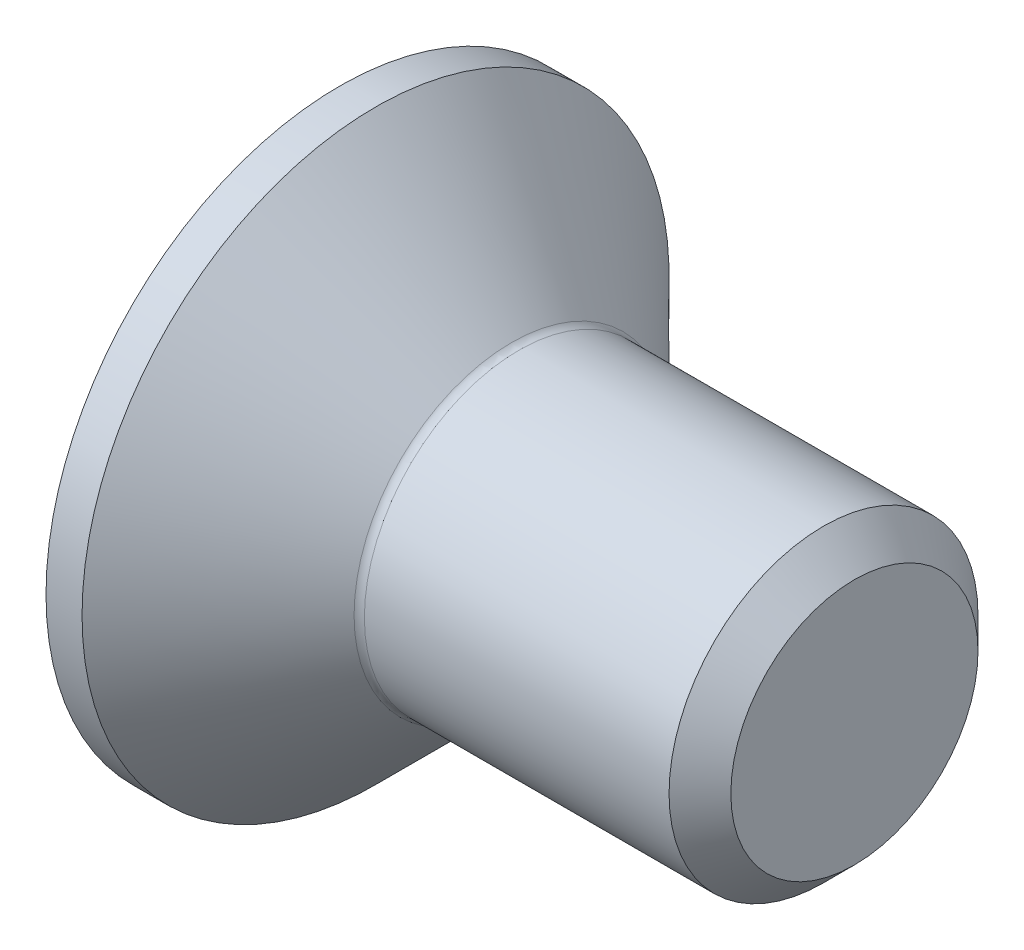
ISO-10303-21;
HEADER;
FILE_DESCRIPTION(('STEP AP214'),'2;1');
FILE_NAME('part.step','',(''),(''),'','','');
FILE_SCHEMA(('AUTOMOTIVE_DESIGN { 1 0 10303 214 1 1 1 1 }'));
ENDSEC;
DATA;
#1=APPLICATION_CONTEXT('core data for automotive mechanical design processes');
#2=APPLICATION_PROTOCOL_DEFINITION('international standard','automotive_design',2000,#1);
#3=PRODUCT_CONTEXT('',#1,'mechanical');
#4=PRODUCT('Part','Part','',(#3));
#5=PRODUCT_RELATED_PRODUCT_CATEGORY('part','',(#4));
#6=PRODUCT_DEFINITION_FORMATION('','',#4);
#7=PRODUCT_DEFINITION_CONTEXT('part definition',#1,'design');
#8=PRODUCT_DEFINITION('design','',#6,#7);
#9=PRODUCT_DEFINITION_SHAPE('','',#8);
#10=(LENGTH_UNIT() NAMED_UNIT(*) SI_UNIT(.MILLI.,.METRE.));
#11=(NAMED_UNIT(*) PLANE_ANGLE_UNIT() SI_UNIT($,.RADIAN.));
#12=(NAMED_UNIT(*) SI_UNIT($,.STERADIAN.) SOLID_ANGLE_UNIT());
#13=UNCERTAINTY_MEASURE_WITH_UNIT(LENGTH_MEASURE(1.E-05),#10,'distance_accuracy_value','');
#14=(GEOMETRIC_REPRESENTATION_CONTEXT(3) GLOBAL_UNCERTAINTY_ASSIGNED_CONTEXT((#13)) GLOBAL_UNIT_ASSIGNED_CONTEXT((#10,
#11,#12)) REPRESENTATION_CONTEXT('',''));
#15=CARTESIAN_POINT('',(0.,0.,0.));
#16=DIRECTION('',(0.,0.,1.));
#17=DIRECTION('',(1.,0.,0.));
#18=AXIS2_PLACEMENT_3D('',#15,#16,#17);
#19=CARTESIAN_POINT('',(0.,0.,0.));
#20=DIRECTION('',(-1.,0.,0.));
#21=DIRECTION('',(0.,0.,1.));
#22=AXIS2_PLACEMENT_3D('',#19,#20,#21);
#23=CYLINDRICAL_SURFACE('',#22,1.5);
#24=CARTESIAN_POINT('',(4.69999999999999,0.,0.));
#25=DIRECTION('',(1.,0.,0.));
#26=DIRECTION('',(0.,0.,-1.));
#27=AXIS2_PLACEMENT_3D('',#24,#25,#26);
#28=CIRCLE('',#27,1.5);
#29=CARTESIAN_POINT('',(4.69999999999999,0.,-1.5));
#30=VERTEX_POINT('',#29);
#31=EDGE_CURVE('E53',#30,#30,#28,.F.);
#32=ORIENTED_EDGE('',*,*,#31,.T.);
#33=EDGE_LOOP('',(#32));
#34=FACE_BOUND('',#33,.T.);
#35=CARTESIAN_POINT('',(1.74142135623731,0.,0.));
#36=DIRECTION('',(-1.,0.,0.));
#37=DIRECTION('',(0.,0.,1.));
#38=AXIS2_PLACEMENT_3D('',#35,#36,#37);
#39=CIRCLE('',#38,1.5);
#40=CARTESIAN_POINT('',(1.74142135623731,0.,1.5));
#41=VERTEX_POINT('',#40);
#42=EDGE_CURVE('E177',#41,#41,#39,.F.);
#43=ORIENTED_EDGE('',*,*,#42,.T.);
#44=EDGE_LOOP('',(#43));
#45=FACE_BOUND('',#44,.T.);
#46=ADVANCED_FACE('F43',(#34,#45),#23,.T.);
#47=CARTESIAN_POINT('',(0.,0.,0.));
#48=DIRECTION('',(-1.,0.,0.));
#49=DIRECTION('',(0.,0.,1.));
#50=AXIS2_PLACEMENT_3D('',#47,#48,#49);
#51=PLANE('',#50);
#52=CARTESIAN_POINT('',(0.,0.,0.));
#53=DIRECTION('',(-1.,0.,0.));
#54=DIRECTION('',(0.,0.,1.));
#55=AXIS2_PLACEMENT_3D('',#52,#53,#54);
#56=CIRCLE('',#55,2.85);
#57=CARTESIAN_POINT('',(0.,0.,2.85));
#58=VERTEX_POINT('',#57);
#59=EDGE_CURVE('E169',#58,#58,#56,.T.);
#60=ORIENTED_EDGE('',*,*,#59,.T.);
#61=EDGE_LOOP('',(#60));
#62=FACE_BOUND('',#61,.T.);
#63=DIRECTION('',(0.,-0.500000000000005,-0.866025403784435));
#64=VECTOR('',#63,1.);
#65=CARTESIAN_POINT('',(0.,-0.58312377188152,1.01));
#66=LINE('',#65,#64);
#67=CARTESIAN_POINT('',(0.,-0.58312377188152,1.01));
#68=VERTEX_POINT('',#67);
#69=CARTESIAN_POINT('',(0.,-1.16624754376305,0.));
#70=VERTEX_POINT('',#69);
#71=EDGE_CURVE('E131',#68,#70,#66,.T.);
#72=ORIENTED_EDGE('',*,*,#71,.T.);
#73=DIRECTION('',(0.,0.500000000000005,-0.866025403784436));
#74=VECTOR('',#73,1.);
#75=CARTESIAN_POINT('',(0.,-1.16624754376305,0.));
#76=LINE('',#75,#74);
#77=CARTESIAN_POINT('',(0.,-0.583123771881521,-1.01));
#78=VERTEX_POINT('',#77);
#79=EDGE_CURVE('E60',#70,#78,#76,.T.);
#80=ORIENTED_EDGE('',*,*,#79,.T.);
#81=DIRECTION('',(0.,1.,0.));
#82=VECTOR('',#81,1.);
#83=CARTESIAN_POINT('',(0.,-0.583123771881521,-1.01));
#84=LINE('',#83,#82);
#85=CARTESIAN_POINT('',(0.,0.583123771881522,-1.01));
#86=VERTEX_POINT('',#85);
#87=EDGE_CURVE('E147',#78,#86,#84,.T.);
#88=ORIENTED_EDGE('',*,*,#87,.T.);
#89=DIRECTION('',(0.,0.500000000000003,0.866025403784437));
#90=VECTOR('',#89,1.);
#91=CARTESIAN_POINT('',(0.,0.583123771881522,-1.01));
#92=LINE('',#91,#90);
#93=CARTESIAN_POINT('',(0.,1.16624754376305,0.));
#94=VERTEX_POINT('',#93);
#95=EDGE_CURVE('E258',#86,#94,#92,.T.);
#96=ORIENTED_EDGE('',*,*,#95,.T.);
#97=DIRECTION('',(0.,-0.500000000000002,0.866025403784438));
#98=VECTOR('',#97,1.);
#99=CARTESIAN_POINT('',(0.,1.16624754376305,0.));
#100=LINE('',#99,#98);
#101=CARTESIAN_POINT('',(0.,0.583123771881522,1.01));
#102=VERTEX_POINT('',#101);
#103=EDGE_CURVE('E238',#94,#102,#100,.T.);
#104=ORIENTED_EDGE('',*,*,#103,.T.);
#105=DIRECTION('',(0.,-1.,0.));
#106=VECTOR('',#105,1.);
#107=CARTESIAN_POINT('',(0.,0.583123771881522,1.01));
#108=LINE('',#107,#106);
#109=EDGE_CURVE('E231',#102,#68,#108,.T.);
#110=ORIENTED_EDGE('',*,*,#109,.T.);
#111=EDGE_LOOP('',(#72,#80,#88,#96,#104,#110));
#112=FACE_BOUND('',#111,.T.);
#113=ADVANCED_FACE('F197',(#62,#112),#51,.T.);
#114=CARTESIAN_POINT('',(0.,0.,0.));
#115=DIRECTION('',(-1.,0.,0.));
#116=DIRECTION('',(0.,0.,1.));
#117=AXIS2_PLACEMENT_3D('',#114,#115,#116);
#118=CYLINDRICAL_SURFACE('',#117,2.85);
#119=CARTESIAN_POINT('',(0.350000000000015,0.,0.));
#120=DIRECTION('',(-1.,0.,0.));
#121=DIRECTION('',(0.,0.,1.));
#122=AXIS2_PLACEMENT_3D('',#119,#120,#121);
#123=CIRCLE('',#122,2.85);
#124=CARTESIAN_POINT('',(0.350000000000015,0.,2.85));
#125=VERTEX_POINT('',#124);
#126=EDGE_CURVE('E164',#125,#125,#123,.T.);
#127=ORIENTED_EDGE('',*,*,#126,.T.);
#128=EDGE_LOOP('',(#127));
#129=FACE_BOUND('',#128,.T.);
#130=ORIENTED_EDGE('',*,*,#59,.F.);
#131=EDGE_LOOP('',(#130));
#132=FACE_BOUND('',#131,.T.);
#133=ADVANCED_FACE('F202',(#129,#132),#118,.T.);
#134=CARTESIAN_POINT('',(0.350000000000015,0.,0.));
#135=DIRECTION('',(-1.,0.,0.));
#136=DIRECTION('',(0.,0.,1.));
#137=AXIS2_PLACEMENT_3D('',#134,#135,#136);
#138=CONICAL_SURFACE('',#137,2.85,0.785398163397452);
#139=CARTESIAN_POINT('',(1.67071067811866,0.,0.));
#140=DIRECTION('',(-1.,0.,0.));
#141=DIRECTION('',(0.,0.,1.));
#142=AXIS2_PLACEMENT_3D('',#139,#140,#141);
#143=CIRCLE('',#142,1.52928932188135);
#144=CARTESIAN_POINT('',(1.67071067811866,0.,1.52928932188135));
#145=VERTEX_POINT('',#144);
#146=EDGE_CURVE('E173',#145,#145,#143,.T.);
#147=ORIENTED_EDGE('',*,*,#146,.T.);
#148=EDGE_LOOP('',(#147));
#149=FACE_BOUND('',#148,.T.);
#150=ORIENTED_EDGE('',*,*,#126,.F.);
#151=EDGE_LOOP('',(#150));
#152=FACE_BOUND('',#151,.T.);
#153=ADVANCED_FACE('F208',(#149,#152),#138,.T.);
#154=CARTESIAN_POINT('',(1.74142135623731,0.,0.));
#155=DIRECTION('',(-1.,0.,0.));
#156=DIRECTION('',(0.,0.,1.));
#157=AXIS2_PLACEMENT_3D('',#154,#155,#156);
#158=TOROIDAL_SURFACE('',#157,1.6,0.1);
#159=ORIENTED_EDGE('',*,*,#42,.F.);
#160=EDGE_LOOP('',(#159));
#161=FACE_BOUND('',#160,.T.);
#162=ORIENTED_EDGE('',*,*,#146,.F.);
#163=EDGE_LOOP('',(#162));
#164=FACE_BOUND('',#163,.T.);
#165=ADVANCED_FACE('F211',(#161,#164),#158,.F.);
#166=CARTESIAN_POINT('',(1.2,-1.16624754376305,0.));
#167=DIRECTION('',(0.,0.866025403784436,0.500000000000005));
#168=DIRECTION('',(0.,-0.500000000000005,0.866025403784436));
#169=AXIS2_PLACEMENT_3D('',#166,#167,#168);
#170=PLANE('',#169);
#171=ORIENTED_EDGE('',*,*,#79,.F.);
#172=DIRECTION('',(-1.,0.,0.));
#173=VECTOR('',#172,1.);
#174=CARTESIAN_POINT('',(1.2,-1.16624754376305,0.));
#175=LINE('',#174,#173);
#176=CARTESIAN_POINT('',(1.2,-1.16624754376305,0.));
#177=VERTEX_POINT('',#176);
#178=EDGE_CURVE('E242',#177,#70,#175,.T.);
#179=ORIENTED_EDGE('',*,*,#178,.F.);
#180=DIRECTION('',(0.,0.500000000000005,-0.866025403784436));
#181=VECTOR('',#180,1.);
#182=CARTESIAN_POINT('',(1.2,-1.16624754376305,0.));
#183=LINE('',#182,#181);
#184=CARTESIAN_POINT('',(1.2,-0.874685657822283,-0.505000000000006));
#185=VERTEX_POINT('',#184);
#186=EDGE_CURVE('E127',#177,#185,#183,.T.);
#187=ORIENTED_EDGE('',*,*,#186,.T.);
#188=CARTESIAN_POINT('',(1.2,-0.583123771881521,-1.01));
#189=VERTEX_POINT('',#188);
#190=EDGE_CURVE('E121',#185,#189,#183,.T.);
#191=ORIENTED_EDGE('',*,*,#190,.T.);
#192=DIRECTION('',(-1.,0.,0.));
#193=VECTOR('',#192,1.);
#194=CARTESIAN_POINT('',(1.2,-0.583123771881521,-1.01));
#195=LINE('',#194,#193);
#196=EDGE_CURVE('E125',#189,#78,#195,.T.);
#197=ORIENTED_EDGE('',*,*,#196,.T.);
#198=EDGE_LOOP('',(#171,#179,#187,#191,#197));
#199=FACE_BOUND('',#198,.T.);
#200=ADVANCED_FACE('F123',(#199),#170,.T.);
#201=CARTESIAN_POINT('',(1.2,-0.583123771881521,-1.01));
#202=DIRECTION('',(0.,0.,1.));
#203=DIRECTION('',(0.,-1.,0.));
#204=AXIS2_PLACEMENT_3D('',#201,#202,#203);
#205=PLANE('',#204);
#206=ORIENTED_EDGE('',*,*,#87,.F.);
#207=ORIENTED_EDGE('',*,*,#196,.F.);
#208=DIRECTION('',(0.,1.,0.));
#209=VECTOR('',#208,1.);
#210=CARTESIAN_POINT('',(1.2,-0.583123771881521,-1.01));
#211=LINE('',#210,#209);
#212=CARTESIAN_POINT('',(1.2,0.,-1.01));
#213=VERTEX_POINT('',#212);
#214=EDGE_CURVE('E134',#189,#213,#211,.T.);
#215=ORIENTED_EDGE('',*,*,#214,.T.);
#216=CARTESIAN_POINT('',(1.2,0.583123771881522,-1.01));
#217=VERTEX_POINT('',#216);
#218=EDGE_CURVE('E142',#213,#217,#211,.T.);
#219=ORIENTED_EDGE('',*,*,#218,.T.);
#220=DIRECTION('',(-1.,0.,0.));
#221=VECTOR('',#220,1.);
#222=CARTESIAN_POINT('',(1.2,0.583123771881522,-1.01));
#223=LINE('',#222,#221);
#224=EDGE_CURVE('E150',#217,#86,#223,.T.);
#225=ORIENTED_EDGE('',*,*,#224,.T.);
#226=EDGE_LOOP('',(#206,#207,#215,#219,#225));
#227=FACE_BOUND('',#226,.T.);
#228=ADVANCED_FACE('F144',(#227),#205,.T.);
#229=CARTESIAN_POINT('',(1.2,0.583123771881522,-1.01));
#230=DIRECTION('',(0.,-0.866025403784437,0.500000000000003));
#231=DIRECTION('',(0.,-0.500000000000003,-0.866025403784437));
#232=AXIS2_PLACEMENT_3D('',#229,#230,#231);
#233=PLANE('',#232);
#234=ORIENTED_EDGE('',*,*,#95,.F.);
#235=ORIENTED_EDGE('',*,*,#224,.F.);
#236=DIRECTION('',(0.,0.500000000000003,0.866025403784437));
#237=VECTOR('',#236,1.);
#238=CARTESIAN_POINT('',(1.2,0.583123771881522,-1.01));
#239=LINE('',#238,#237);
#240=CARTESIAN_POINT('',(1.2,0.874685657822282,-0.505000000000003));
#241=VERTEX_POINT('',#240);
#242=EDGE_CURVE('E281',#217,#241,#239,.T.);
#243=ORIENTED_EDGE('',*,*,#242,.T.);
#244=CARTESIAN_POINT('',(1.2,1.16624754376305,0.));
#245=VERTEX_POINT('',#244);
#246=EDGE_CURVE('E141',#241,#245,#239,.T.);
#247=ORIENTED_EDGE('',*,*,#246,.T.);
#248=DIRECTION('',(-1.,0.,0.));
#249=VECTOR('',#248,1.);
#250=CARTESIAN_POINT('',(1.2,1.16624754376305,0.));
#251=LINE('',#250,#249);
#252=EDGE_CURVE('E158',#245,#94,#251,.T.);
#253=ORIENTED_EDGE('',*,*,#252,.T.);
#254=EDGE_LOOP('',(#234,#235,#243,#247,#253));
#255=FACE_BOUND('',#254,.T.);
#256=ADVANCED_FACE('F256',(#255),#233,.T.);
#257=CARTESIAN_POINT('',(1.2,1.16624754376305,0.));
#258=DIRECTION('',(0.,-0.866025403784438,-0.500000000000002));
#259=DIRECTION('',(0.,0.500000000000002,-0.866025403784438));
#260=AXIS2_PLACEMENT_3D('',#257,#258,#259);
#261=PLANE('',#260);
#262=ORIENTED_EDGE('',*,*,#103,.F.);
#263=ORIENTED_EDGE('',*,*,#252,.F.);
#264=DIRECTION('',(0.,-0.500000000000002,0.866025403784438));
#265=VECTOR('',#264,1.);
#266=CARTESIAN_POINT('',(1.2,1.16624754376305,0.));
#267=LINE('',#266,#265);
#268=CARTESIAN_POINT('',(1.2,0.874685657822282,0.505000000000002));
#269=VERTEX_POINT('',#268);
#270=EDGE_CURVE('E68',#245,#269,#267,.T.);
#271=ORIENTED_EDGE('',*,*,#270,.T.);
#272=CARTESIAN_POINT('',(1.2,0.583123771881522,1.01));
#273=VERTEX_POINT('',#272);
#274=EDGE_CURVE('E280',#269,#273,#267,.T.);
#275=ORIENTED_EDGE('',*,*,#274,.T.);
#276=DIRECTION('',(-1.,0.,0.));
#277=VECTOR('',#276,1.);
#278=CARTESIAN_POINT('',(1.2,0.583123771881522,1.01));
#279=LINE('',#278,#277);
#280=EDGE_CURVE('E249',#273,#102,#279,.T.);
#281=ORIENTED_EDGE('',*,*,#280,.T.);
#282=EDGE_LOOP('',(#262,#263,#271,#275,#281));
#283=FACE_BOUND('',#282,.T.);
#284=ADVANCED_FACE('F332',(#283),#261,.T.);
#285=CARTESIAN_POINT('',(1.2,0.583123771881522,1.01));
#286=DIRECTION('',(0.,0.,-1.));
#287=DIRECTION('',(0.,1.,0.));
#288=AXIS2_PLACEMENT_3D('',#285,#286,#287);
#289=PLANE('',#288);
#290=ORIENTED_EDGE('',*,*,#109,.F.);
#291=ORIENTED_EDGE('',*,*,#280,.F.);
#292=DIRECTION('',(0.,-1.,0.));
#293=VECTOR('',#292,1.);
#294=CARTESIAN_POINT('',(1.2,0.583123771881522,1.01));
#295=LINE('',#294,#293);
#296=CARTESIAN_POINT('',(1.2,0.,1.01));
#297=VERTEX_POINT('',#296);
#298=EDGE_CURVE('E273',#273,#297,#295,.T.);
#299=ORIENTED_EDGE('',*,*,#298,.T.);
#300=CARTESIAN_POINT('',(1.2,-0.58312377188152,1.01));
#301=VERTEX_POINT('',#300);
#302=EDGE_CURVE('E277',#297,#301,#295,.T.);
#303=ORIENTED_EDGE('',*,*,#302,.T.);
#304=DIRECTION('',(-1.,0.,0.));
#305=VECTOR('',#304,1.);
#306=CARTESIAN_POINT('',(1.2,-0.58312377188152,1.01));
#307=LINE('',#306,#305);
#308=EDGE_CURVE('E245',#301,#68,#307,.T.);
#309=ORIENTED_EDGE('',*,*,#308,.T.);
#310=EDGE_LOOP('',(#290,#291,#299,#303,#309));
#311=FACE_BOUND('',#310,.T.);
#312=ADVANCED_FACE('F327',(#311),#289,.T.);
#313=CARTESIAN_POINT('',(1.2,-0.58312377188152,1.01));
#314=DIRECTION('',(0.,0.866025403784435,-0.500000000000005));
#315=DIRECTION('',(0.,0.500000000000005,0.866025403784436));
#316=AXIS2_PLACEMENT_3D('',#313,#314,#315);
#317=PLANE('',#316);
#318=ORIENTED_EDGE('',*,*,#71,.F.);
#319=ORIENTED_EDGE('',*,*,#308,.F.);
#320=DIRECTION('',(0.,-0.500000000000005,-0.866025403784435));
#321=VECTOR('',#320,1.);
#322=CARTESIAN_POINT('',(1.2,-0.58312377188152,1.01));
#323=LINE('',#322,#321);
#324=CARTESIAN_POINT('',(1.2,-0.874685657822282,0.505000000000007));
#325=VERTEX_POINT('',#324);
#326=EDGE_CURVE('E246',#301,#325,#323,.T.);
#327=ORIENTED_EDGE('',*,*,#326,.T.);
#328=EDGE_CURVE('E272',#325,#177,#323,.T.);
#329=ORIENTED_EDGE('',*,*,#328,.T.);
#330=ORIENTED_EDGE('',*,*,#178,.T.);
#331=EDGE_LOOP('',(#318,#319,#327,#329,#330));
#332=FACE_BOUND('',#331,.T.);
#333=ADVANCED_FACE('F300',(#332),#317,.T.);
#334=CARTESIAN_POINT('',(1.2,-1.16624754376305,0.));
#335=DIRECTION('',(-1.,0.,0.));
#336=DIRECTION('',(0.,0.,1.));
#337=AXIS2_PLACEMENT_3D('',#334,#335,#336);
#338=PLANE('',#337);
#339=CARTESIAN_POINT('',(1.2,0.,0.));
#340=DIRECTION('',(-1.,0.,0.));
#341=DIRECTION('',(0.,0.,1.));
#342=AXIS2_PLACEMENT_3D('',#339,#340,#341);
#343=CIRCLE('',#342,1.01);
#344=EDGE_CURVE('E149',#325,#297,#343,.T.);
#345=ORIENTED_EDGE('',*,*,#344,.F.);
#346=ORIENTED_EDGE('',*,*,#326,.F.);
#347=ORIENTED_EDGE('',*,*,#302,.F.);
#348=EDGE_LOOP('',(#345,#346,#347));
#349=FACE_BOUND('',#348,.T.);
#350=ADVANCED_FACE('F316',(#349),#338,.T.);
#351=EDGE_CURVE('E155',#185,#325,#343,.T.);
#352=ORIENTED_EDGE('',*,*,#351,.F.);
#353=ORIENTED_EDGE('',*,*,#186,.F.);
#354=ORIENTED_EDGE('',*,*,#328,.F.);
#355=EDGE_LOOP('',(#352,#353,#354));
#356=FACE_BOUND('',#355,.T.);
#357=ADVANCED_FACE('F304',(#356),#338,.T.);
#358=EDGE_CURVE('E136',#213,#185,#343,.T.);
#359=ORIENTED_EDGE('',*,*,#358,.F.);
#360=ORIENTED_EDGE('',*,*,#214,.F.);
#361=ORIENTED_EDGE('',*,*,#190,.F.);
#362=EDGE_LOOP('',(#359,#360,#361));
#363=FACE_BOUND('',#362,.T.);
#364=ADVANCED_FACE('F135',(#363),#338,.T.);
#365=EDGE_CURVE('E289',#241,#213,#343,.T.);
#366=ORIENTED_EDGE('',*,*,#365,.F.);
#367=ORIENTED_EDGE('',*,*,#242,.F.);
#368=ORIENTED_EDGE('',*,*,#218,.F.);
#369=EDGE_LOOP('',(#366,#367,#368));
#370=FACE_BOUND('',#369,.T.);
#371=ADVANCED_FACE('F288',(#370),#338,.T.);
#372=EDGE_CURVE('E165',#269,#241,#343,.T.);
#373=ORIENTED_EDGE('',*,*,#372,.F.);
#374=ORIENTED_EDGE('',*,*,#270,.F.);
#375=ORIENTED_EDGE('',*,*,#246,.F.);
#376=EDGE_LOOP('',(#373,#374,#375));
#377=FACE_BOUND('',#376,.T.);
#378=ADVANCED_FACE('F294',(#377),#338,.T.);
#379=EDGE_CURVE('E157',#297,#269,#343,.T.);
#380=ORIENTED_EDGE('',*,*,#379,.F.);
#381=ORIENTED_EDGE('',*,*,#298,.F.);
#382=ORIENTED_EDGE('',*,*,#274,.F.);
#383=EDGE_LOOP('',(#380,#381,#382));
#384=FACE_BOUND('',#383,.T.);
#385=ADVANCED_FACE('F308',(#384),#338,.T.);
#386=CARTESIAN_POINT('',(1.2,0.,0.));
#387=DIRECTION('',(-1.,0.,0.));
#388=DIRECTION('',(0.,0.,1.));
#389=AXIS2_PLACEMENT_3D('',#386,#387,#388);
#390=CONICAL_SURFACE('',#389,1.01,1.04719755119659);
#391=CARTESIAN_POINT('',(1.78312377188153,0.,0.));
#392=VERTEX_POINT('',#391);
#393=VERTEX_LOOP('',#392);
#394=FACE_BOUND('',#393,.T.);
#395=ORIENTED_EDGE('',*,*,#379,.T.);
#396=ORIENTED_EDGE('',*,*,#372,.T.);
#397=ORIENTED_EDGE('',*,*,#365,.T.);
#398=ORIENTED_EDGE('',*,*,#358,.T.);
#399=ORIENTED_EDGE('',*,*,#351,.T.);
#400=ORIENTED_EDGE('',*,*,#344,.T.);
#401=EDGE_LOOP('',(#395,#396,#397,#398,#399,#400));
#402=FACE_BOUND('',#401,.T.);
#403=ADVANCED_FACE('F192',(#394,#402),#390,.F.);
#404=CARTESIAN_POINT('',(4.99999999999999,0.,0.));
#405=DIRECTION('',(1.,0.,0.));
#406=DIRECTION('',(0.,0.,-1.));
#407=AXIS2_PLACEMENT_3D('',#404,#405,#406);
#408=PLANE('',#407);
#409=CARTESIAN_POINT('',(4.99999999999999,0.,0.));
#410=DIRECTION('',(1.,0.,0.));
#411=DIRECTION('',(0.,0.,-1.));
#412=AXIS2_PLACEMENT_3D('',#409,#410,#411);
#413=CIRCLE('',#412,1.2);
#414=CARTESIAN_POINT('',(4.99999999999999,0.,-1.2));
#415=VERTEX_POINT('',#414);
#416=EDGE_CURVE('E11',#415,#415,#413,.T.);
#417=ORIENTED_EDGE('',*,*,#416,.T.);
#418=EDGE_LOOP('',(#417));
#419=FACE_BOUND('',#418,.T.);
#420=ADVANCED_FACE('F187',(#419),#408,.T.);
#421=CARTESIAN_POINT('',(4.69999999999999,0.,0.));
#422=DIRECTION('',(-1.,0.,0.));
#423=DIRECTION('',(0.,0.,1.));
#424=AXIS2_PLACEMENT_3D('',#421,#422,#423);
#425=CONICAL_SURFACE('',#424,1.5,0.78539816339745);
#426=ORIENTED_EDGE('',*,*,#416,.F.);
#427=EDGE_LOOP('',(#426));
#428=FACE_BOUND('',#427,.T.);
#429=ORIENTED_EDGE('',*,*,#31,.F.);
#430=EDGE_LOOP('',(#429));
#431=FACE_BOUND('',#430,.T.);
#432=ADVANCED_FACE('F46',(#428,#431),#425,.T.);
#433=CLOSED_SHELL('',(#46,#113,#133,#153,#165,#200,#228,#256,#284,#312,#333,#350,#357,#364,#371,
#378,#385,#403,#420,#432));
#434=MANIFOLD_SOLID_BREP('B2',#433);
#435=ADVANCED_BREP_SHAPE_REPRESENTATION('',(#18,#434),#14);
#436=SHAPE_DEFINITION_REPRESENTATION(#9,#435);
ENDSEC;
END-ISO-10303-21;
